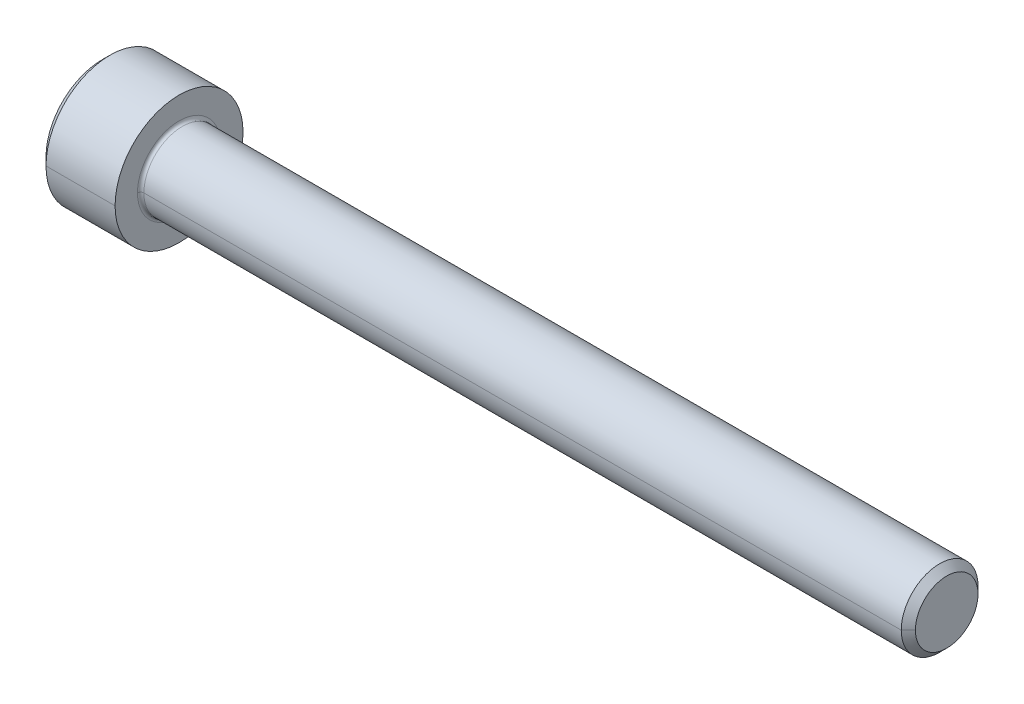
ISO-10303-21;
HEADER;
FILE_DESCRIPTION(('STEP AP214'),'2;1');
FILE_NAME('part.step','',(''),(''),'','','');
FILE_SCHEMA(('AUTOMOTIVE_DESIGN { 1 0 10303 214 1 1 1 1 }'));
ENDSEC;
DATA;
#1=APPLICATION_CONTEXT('core data for automotive mechanical design processes');
#2=APPLICATION_PROTOCOL_DEFINITION('international standard','automotive_design',2000,#1);
#3=PRODUCT_CONTEXT('',#1,'mechanical');
#4=PRODUCT('Part','Part','',(#3));
#5=PRODUCT_RELATED_PRODUCT_CATEGORY('part','',(#4));
#6=PRODUCT_DEFINITION_FORMATION('','',#4);
#7=PRODUCT_DEFINITION_CONTEXT('part definition',#1,'design');
#8=PRODUCT_DEFINITION('design','',#6,#7);
#9=PRODUCT_DEFINITION_SHAPE('','',#8);
#10=(LENGTH_UNIT() NAMED_UNIT(*) SI_UNIT(.MILLI.,.METRE.));
#11=(NAMED_UNIT(*) PLANE_ANGLE_UNIT() SI_UNIT($,.RADIAN.));
#12=(NAMED_UNIT(*) SI_UNIT($,.STERADIAN.) SOLID_ANGLE_UNIT());
#13=UNCERTAINTY_MEASURE_WITH_UNIT(LENGTH_MEASURE(1.E-05),#10,'distance_accuracy_value','');
#14=(GEOMETRIC_REPRESENTATION_CONTEXT(3) GLOBAL_UNCERTAINTY_ASSIGNED_CONTEXT((#13)) GLOBAL_UNIT_ASSIGNED_CONTEXT((#10,
#11,#12)) REPRESENTATION_CONTEXT('',''));
#15=CARTESIAN_POINT('',(0.,0.,0.));
#16=DIRECTION('',(0.,0.,1.));
#17=DIRECTION('',(1.,0.,0.));
#18=AXIS2_PLACEMENT_3D('',#15,#16,#17);
#19=CARTESIAN_POINT('',(3.,0.,0.));
#20=DIRECTION('',(-1.,0.,0.));
#21=DIRECTION('',(0.,0.,1.));
#22=AXIS2_PLACEMENT_3D('',#19,#20,#21);
#23=CONICAL_SURFACE('',#22,2.542,1.0471975511966);
#24=DIRECTION('',(-0.5,0.,-0.866025403784437));
#25=VECTOR('',#24,1.);
#26=CARTESIAN_POINT('',(3.,0.,-2.542));
#27=LINE('',#26,#25);
#28=CARTESIAN_POINT('',(4.46762438428004,0.,0.));
#29=VERTEX_POINT('',#28);
#30=CARTESIAN_POINT('',(3.,0.,-2.542));
#31=VERTEX_POINT('',#30);
#32=EDGE_CURVE('E348',#29,#31,#27,.T.);
#33=ORIENTED_EDGE('',*,*,#32,.F.);
#34=DIRECTION('',(-0.5,0.,0.866025403784437));
#35=VECTOR('',#34,1.);
#36=CARTESIAN_POINT('',(3.,0.,2.542));
#37=LINE('',#36,#35);
#38=CARTESIAN_POINT('',(3.,0.,2.542));
#39=VERTEX_POINT('',#38);
#40=EDGE_CURVE('E352',#29,#39,#37,.T.);
#41=ORIENTED_EDGE('',*,*,#40,.T.);
#42=CARTESIAN_POINT('',(3.,0.,0.));
#43=DIRECTION('',(-1.,0.,0.));
#44=DIRECTION('',(0.,0.,1.));
#45=AXIS2_PLACEMENT_3D('',#42,#43,#44);
#46=CIRCLE('',#45,2.542);
#47=CARTESIAN_POINT('',(3.,2.20143657642005,1.271));
#48=VERTEX_POINT('',#47);
#49=EDGE_CURVE('E174',#39,#48,#46,.T.);
#50=ORIENTED_EDGE('',*,*,#49,.T.);
#51=CARTESIAN_POINT('',(3.,0.,0.));
#52=DIRECTION('',(-1.,0.,0.));
#53=DIRECTION('',(0.,0.,1.));
#54=AXIS2_PLACEMENT_3D('',#51,#52,#53);
#55=CIRCLE('',#54,2.542);
#56=CARTESIAN_POINT('',(3.,2.20143657642004,-1.271));
#57=VERTEX_POINT('',#56);
#58=EDGE_CURVE('E24',#48,#57,#55,.T.);
#59=ORIENTED_EDGE('',*,*,#58,.T.);
#60=CARTESIAN_POINT('',(3.,0.,0.));
#61=DIRECTION('',(-1.,0.,0.));
#62=DIRECTION('',(0.,0.,1.));
#63=AXIS2_PLACEMENT_3D('',#60,#61,#62);
#64=CIRCLE('',#63,2.542);
#65=EDGE_CURVE('E11',#57,#31,#64,.T.);
#66=ORIENTED_EDGE('',*,*,#65,.T.);
#67=EDGE_LOOP('',(#33,#41,#50,#59,#66));
#68=FACE_BOUND('',#67,.T.);
#69=ADVANCED_FACE('F16',(#68),#23,.F.);
#70=CARTESIAN_POINT('',(3.,4.40287315284008,-2.542));
#71=DIRECTION('',(1.,0.,0.));
#72=DIRECTION('',(0.,1.,0.));
#73=AXIS2_PLACEMENT_3D('',#70,#71,#72);
#74=PLANE('',#73);
#75=DIRECTION('',(0.,-0.5,-0.866025403784438));
#76=VECTOR('',#75,1.);
#77=CARTESIAN_POINT('',(3.,2.93524876856006,0.));
#78=LINE('',#77,#76);
#79=CARTESIAN_POINT('',(3.,1.46762438428002,-2.542));
#80=VERTEX_POINT('',#79);
#81=EDGE_CURVE('E45',#57,#80,#78,.T.);
#82=ORIENTED_EDGE('',*,*,#81,.T.);
#83=DIRECTION('',(0.,-1.,0.));
#84=VECTOR('',#83,1.);
#85=CARTESIAN_POINT('',(3.,1.46762438428002,-2.542));
#86=LINE('',#85,#84);
#87=EDGE_CURVE('E162',#80,#31,#86,.T.);
#88=ORIENTED_EDGE('',*,*,#87,.T.);
#89=ORIENTED_EDGE('',*,*,#65,.F.);
#90=EDGE_LOOP('',(#82,#88,#89));
#91=FACE_BOUND('',#90,.T.);
#92=ADVANCED_FACE('F447',(#91),#74,.F.);
#93=CARTESIAN_POINT('',(3.,4.40287315284008,-2.542));
#94=DIRECTION('',(1.,0.,0.));
#95=DIRECTION('',(0.,1.,0.));
#96=AXIS2_PLACEMENT_3D('',#93,#94,#95);
#97=PLANE('',#96);
#98=DIRECTION('',(0.,-0.5,0.86602540378444));
#99=VECTOR('',#98,1.);
#100=CARTESIAN_POINT('',(3.,2.93524876856006,0.));
#101=LINE('',#100,#99);
#102=CARTESIAN_POINT('',(3.,2.93524876856006,0.));
#103=VERTEX_POINT('',#102);
#104=EDGE_CURVE('E190',#103,#48,#101,.T.);
#105=ORIENTED_EDGE('',*,*,#104,.F.);
#106=DIRECTION('',(0.,-0.5,-0.866025403784438));
#107=VECTOR('',#106,1.);
#108=CARTESIAN_POINT('',(3.,2.93524876856006,0.));
#109=LINE('',#108,#107);
#110=EDGE_CURVE('E170',#103,#57,#109,.T.);
#111=ORIENTED_EDGE('',*,*,#110,.T.);
#112=ORIENTED_EDGE('',*,*,#58,.F.);
#113=EDGE_LOOP('',(#105,#111,#112));
#114=FACE_BOUND('',#113,.T.);
#115=ADVANCED_FACE('F188',(#114),#97,.F.);
#116=CARTESIAN_POINT('',(3.,4.40287315284008,-2.542));
#117=DIRECTION('',(1.,0.,0.));
#118=DIRECTION('',(0.,1.,0.));
#119=AXIS2_PLACEMENT_3D('',#116,#117,#118);
#120=PLANE('',#119);
#121=DIRECTION('',(0.,1.,0.));
#122=VECTOR('',#121,1.);
#123=CARTESIAN_POINT('',(3.,-1.46762438428003,2.542));
#124=LINE('',#123,#122);
#125=CARTESIAN_POINT('',(3.,1.46762438428003,2.542));
#126=VERTEX_POINT('',#125);
#127=EDGE_CURVE('E215',#39,#126,#124,.T.);
#128=ORIENTED_EDGE('',*,*,#127,.T.);
#129=DIRECTION('',(0.,-0.5,0.86602540378444));
#130=VECTOR('',#129,1.);
#131=CARTESIAN_POINT('',(3.,2.93524876856006,0.));
#132=LINE('',#131,#130);
#133=EDGE_CURVE('E221',#48,#126,#132,.T.);
#134=ORIENTED_EDGE('',*,*,#133,.F.);
#135=ORIENTED_EDGE('',*,*,#49,.F.);
#136=EDGE_LOOP('',(#128,#134,#135));
#137=FACE_BOUND('',#136,.T.);
#138=ADVANCED_FACE('F456',(#137),#120,.F.);
#139=CARTESIAN_POINT('',(3.,4.40287315284008,-2.542));
#140=DIRECTION('',(1.,0.,0.));
#141=DIRECTION('',(0.,1.,0.));
#142=AXIS2_PLACEMENT_3D('',#139,#140,#141);
#143=PLANE('',#142);
#144=DIRECTION('',(0.,-0.5,-0.866025403784438));
#145=VECTOR('',#144,1.);
#146=CARTESIAN_POINT('',(3.,-1.46762438428003,2.542));
#147=LINE('',#146,#145);
#148=CARTESIAN_POINT('',(3.,-1.46762438428003,2.542));
#149=VERTEX_POINT('',#148);
#150=CARTESIAN_POINT('',(3.,-2.20143657642005,1.271));
#151=VERTEX_POINT('',#150);
#152=EDGE_CURVE('E144',#149,#151,#147,.T.);
#153=ORIENTED_EDGE('',*,*,#152,.F.);
#154=DIRECTION('',(0.,1.,0.));
#155=VECTOR('',#154,1.);
#156=CARTESIAN_POINT('',(3.,-1.46762438428003,2.542));
#157=LINE('',#156,#155);
#158=EDGE_CURVE('E211',#149,#39,#157,.T.);
#159=ORIENTED_EDGE('',*,*,#158,.T.);
#160=CARTESIAN_POINT('',(3.,0.,0.));
#161=DIRECTION('',(-1.,0.,0.));
#162=DIRECTION('',(0.,0.,1.));
#163=AXIS2_PLACEMENT_3D('',#160,#161,#162);
#164=CIRCLE('',#163,2.542);
#165=EDGE_CURVE('E336',#151,#39,#164,.T.);
#166=ORIENTED_EDGE('',*,*,#165,.F.);
#167=EDGE_LOOP('',(#153,#159,#166));
#168=FACE_BOUND('',#167,.T.);
#169=ADVANCED_FACE('F461',(#168),#143,.F.);
#170=CARTESIAN_POINT('',(3.,4.40287315284008,-2.542));
#171=DIRECTION('',(1.,0.,0.));
#172=DIRECTION('',(0.,1.,0.));
#173=AXIS2_PLACEMENT_3D('',#170,#171,#172);
#174=PLANE('',#173);
#175=DIRECTION('',(0.,0.5,-0.86602540378444));
#176=VECTOR('',#175,1.);
#177=CARTESIAN_POINT('',(3.,-2.93524876856006,0.));
#178=LINE('',#177,#176);
#179=CARTESIAN_POINT('',(3.,-2.93524876856006,0.));
#180=VERTEX_POINT('',#179);
#181=CARTESIAN_POINT('',(3.,-2.20143657642005,-1.271));
#182=VERTEX_POINT('',#181);
#183=EDGE_CURVE('E116',#180,#182,#178,.T.);
#184=ORIENTED_EDGE('',*,*,#183,.F.);
#185=DIRECTION('',(0.,-0.5,-0.866025403784438));
#186=VECTOR('',#185,1.);
#187=CARTESIAN_POINT('',(3.,-1.46762438428003,2.542));
#188=LINE('',#187,#186);
#189=EDGE_CURVE('E121',#151,#180,#188,.T.);
#190=ORIENTED_EDGE('',*,*,#189,.F.);
#191=CARTESIAN_POINT('',(3.,0.,0.));
#192=DIRECTION('',(-1.,0.,0.));
#193=DIRECTION('',(0.,0.,1.));
#194=AXIS2_PLACEMENT_3D('',#191,#192,#193);
#195=CIRCLE('',#194,2.542);
#196=EDGE_CURVE('E125',#182,#151,#195,.T.);
#197=ORIENTED_EDGE('',*,*,#196,.F.);
#198=EDGE_LOOP('',(#184,#190,#197));
#199=FACE_BOUND('',#198,.T.);
#200=ADVANCED_FACE('F118',(#199),#174,.F.);
#201=CARTESIAN_POINT('',(3.,4.40287315284008,-2.542));
#202=DIRECTION('',(1.,0.,0.));
#203=DIRECTION('',(0.,1.,0.));
#204=AXIS2_PLACEMENT_3D('',#201,#202,#203);
#205=PLANE('',#204);
#206=DIRECTION('',(0.,-1.,0.));
#207=VECTOR('',#206,1.);
#208=CARTESIAN_POINT('',(3.,1.46762438428002,-2.542));
#209=LINE('',#208,#207);
#210=CARTESIAN_POINT('',(3.,-1.46762438428004,-2.542));
#211=VERTEX_POINT('',#210);
#212=EDGE_CURVE('E165',#31,#211,#209,.T.);
#213=ORIENTED_EDGE('',*,*,#212,.T.);
#214=DIRECTION('',(0.,0.5,-0.86602540378444));
#215=VECTOR('',#214,1.);
#216=CARTESIAN_POINT('',(3.,-2.93524876856006,0.));
#217=LINE('',#216,#215);
#218=EDGE_CURVE('E130',#182,#211,#217,.T.);
#219=ORIENTED_EDGE('',*,*,#218,.F.);
#220=CARTESIAN_POINT('',(3.,0.,0.));
#221=DIRECTION('',(-1.,0.,0.));
#222=DIRECTION('',(0.,0.,1.));
#223=AXIS2_PLACEMENT_3D('',#220,#221,#222);
#224=CIRCLE('',#223,2.542);
#225=EDGE_CURVE('E345',#31,#182,#224,.T.);
#226=ORIENTED_EDGE('',*,*,#225,.F.);
#227=EDGE_LOOP('',(#213,#219,#226));
#228=FACE_BOUND('',#227,.T.);
#229=ADVANCED_FACE('F468',(#228),#205,.F.);
#230=CARTESIAN_POINT('',(3.,2.93524876856006,0.));
#231=DIRECTION('',(0.,0.866025403784438,-0.5));
#232=DIRECTION('',(-1.,0.,0.));
#233=AXIS2_PLACEMENT_3D('',#230,#231,#232);
#234=PLANE('',#233);
#235=DIRECTION('',(0.,-0.5,-0.866025403784438));
#236=VECTOR('',#235,1.);
#237=CARTESIAN_POINT('',(0.,2.93524876856006,0.));
#238=LINE('',#237,#236);
#239=CARTESIAN_POINT('',(0.,2.93524876856006,0.));
#240=VERTEX_POINT('',#239);
#241=CARTESIAN_POINT('',(0.,1.46762438428002,-2.542));
#242=VERTEX_POINT('',#241);
#243=EDGE_CURVE('E197',#240,#242,#238,.T.);
#244=ORIENTED_EDGE('',*,*,#243,.T.);
#245=DIRECTION('',(-1.,0.,0.));
#246=VECTOR('',#245,1.);
#247=CARTESIAN_POINT('',(3.,1.46762438428002,-2.542));
#248=LINE('',#247,#246);
#249=EDGE_CURVE('E159',#80,#242,#248,.T.);
#250=ORIENTED_EDGE('',*,*,#249,.F.);
#251=ORIENTED_EDGE('',*,*,#81,.F.);
#252=ORIENTED_EDGE('',*,*,#110,.F.);
#253=DIRECTION('',(-1.,0.,0.));
#254=VECTOR('',#253,1.);
#255=CARTESIAN_POINT('',(3.,2.93524876856006,0.));
#256=LINE('',#255,#254);
#257=EDGE_CURVE('E227',#103,#240,#256,.T.);
#258=ORIENTED_EDGE('',*,*,#257,.T.);
#259=EDGE_LOOP('',(#244,#250,#251,#252,#258));
#260=FACE_BOUND('',#259,.T.);
#261=ADVANCED_FACE('F194',(#260),#234,.F.);
#262=CARTESIAN_POINT('',(3.,1.46762438428002,-2.542));
#263=DIRECTION('',(0.,0.,-1.));
#264=DIRECTION('',(0.,-1.,0.));
#265=AXIS2_PLACEMENT_3D('',#262,#263,#264);
#266=PLANE('',#265);
#267=DIRECTION('',(0.,-1.,0.));
#268=VECTOR('',#267,1.);
#269=CARTESIAN_POINT('',(0.,1.46762438428002,-2.542));
#270=LINE('',#269,#268);
#271=CARTESIAN_POINT('',(0.,-1.46762438428004,-2.542));
#272=VERTEX_POINT('',#271);
#273=EDGE_CURVE('E245',#242,#272,#270,.T.);
#274=ORIENTED_EDGE('',*,*,#273,.T.);
#275=DIRECTION('',(-1.,0.,0.));
#276=VECTOR('',#275,1.);
#277=CARTESIAN_POINT('',(3.,-1.46762438428004,-2.542));
#278=LINE('',#277,#276);
#279=EDGE_CURVE('E158',#211,#272,#278,.T.);
#280=ORIENTED_EDGE('',*,*,#279,.F.);
#281=ORIENTED_EDGE('',*,*,#212,.F.);
#282=ORIENTED_EDGE('',*,*,#87,.F.);
#283=ORIENTED_EDGE('',*,*,#249,.T.);
#284=EDGE_LOOP('',(#274,#280,#281,#282,#283));
#285=FACE_BOUND('',#284,.T.);
#286=ADVANCED_FACE('F202',(#285),#266,.F.);
#287=CARTESIAN_POINT('',(3.,-2.93524876856006,0.));
#288=DIRECTION('',(0.,0.86602540378444,0.5));
#289=DIRECTION('',(1.,0.,0.));
#290=AXIS2_PLACEMENT_3D('',#287,#288,#289);
#291=PLANE('',#290);
#292=DIRECTION('',(0.,0.5,-0.86602540378444));
#293=VECTOR('',#292,1.);
#294=CARTESIAN_POINT('',(0.,-2.93524876856006,0.));
#295=LINE('',#294,#293);
#296=CARTESIAN_POINT('',(0.,-2.93524876856006,0.));
#297=VERTEX_POINT('',#296);
#298=EDGE_CURVE('E136',#297,#272,#295,.T.);
#299=ORIENTED_EDGE('',*,*,#298,.F.);
#300=DIRECTION('',(-1.,0.,0.));
#301=VECTOR('',#300,1.);
#302=CARTESIAN_POINT('',(3.,-2.93524876856006,0.));
#303=LINE('',#302,#301);
#304=EDGE_CURVE('E131',#180,#297,#303,.T.);
#305=ORIENTED_EDGE('',*,*,#304,.F.);
#306=ORIENTED_EDGE('',*,*,#183,.T.);
#307=ORIENTED_EDGE('',*,*,#218,.T.);
#308=ORIENTED_EDGE('',*,*,#279,.T.);
#309=EDGE_LOOP('',(#299,#305,#306,#307,#308));
#310=FACE_BOUND('',#309,.T.);
#311=ADVANCED_FACE('F134',(#310),#291,.T.);
#312=CARTESIAN_POINT('',(3.,-1.46762438428003,2.542));
#313=DIRECTION('',(0.,0.866025403784438,-0.5));
#314=DIRECTION('',(-1.,0.,0.));
#315=AXIS2_PLACEMENT_3D('',#312,#313,#314);
#316=PLANE('',#315);
#317=DIRECTION('',(0.,-0.5,-0.866025403784438));
#318=VECTOR('',#317,1.);
#319=CARTESIAN_POINT('',(0.,-1.46762438428003,2.542));
#320=LINE('',#319,#318);
#321=CARTESIAN_POINT('',(0.,-1.46762438428003,2.542));
#322=VERTEX_POINT('',#321);
#323=EDGE_CURVE('E250',#322,#297,#320,.T.);
#324=ORIENTED_EDGE('',*,*,#323,.F.);
#325=DIRECTION('',(-1.,0.,0.));
#326=VECTOR('',#325,1.);
#327=CARTESIAN_POINT('',(3.,-1.46762438428003,2.542));
#328=LINE('',#327,#326);
#329=EDGE_CURVE('E152',#149,#322,#328,.T.);
#330=ORIENTED_EDGE('',*,*,#329,.F.);
#331=ORIENTED_EDGE('',*,*,#152,.T.);
#332=ORIENTED_EDGE('',*,*,#189,.T.);
#333=ORIENTED_EDGE('',*,*,#304,.T.);
#334=EDGE_LOOP('',(#324,#330,#331,#332,#333));
#335=FACE_BOUND('',#334,.T.);
#336=ADVANCED_FACE('F142',(#335),#316,.T.);
#337=CARTESIAN_POINT('',(3.,-1.46762438428003,2.542));
#338=DIRECTION('',(0.,0.,1.));
#339=DIRECTION('',(0.,-1.,0.));
#340=AXIS2_PLACEMENT_3D('',#337,#338,#339);
#341=PLANE('',#340);
#342=DIRECTION('',(0.,1.,0.));
#343=VECTOR('',#342,1.);
#344=CARTESIAN_POINT('',(0.,-1.46762438428003,2.542));
#345=LINE('',#344,#343);
#346=CARTESIAN_POINT('',(0.,1.46762438428003,2.542));
#347=VERTEX_POINT('',#346);
#348=EDGE_CURVE('E251',#322,#347,#345,.T.);
#349=ORIENTED_EDGE('',*,*,#348,.T.);
#350=DIRECTION('',(-1.,0.,0.));
#351=VECTOR('',#350,1.);
#352=CARTESIAN_POINT('',(3.,1.46762438428003,2.542));
#353=LINE('',#352,#351);
#354=EDGE_CURVE('E218',#126,#347,#353,.T.);
#355=ORIENTED_EDGE('',*,*,#354,.F.);
#356=ORIENTED_EDGE('',*,*,#127,.F.);
#357=ORIENTED_EDGE('',*,*,#158,.F.);
#358=ORIENTED_EDGE('',*,*,#329,.T.);
#359=EDGE_LOOP('',(#349,#355,#356,#357,#358));
#360=FACE_BOUND('',#359,.T.);
#361=ADVANCED_FACE('F480',(#360),#341,.F.);
#362=CARTESIAN_POINT('',(3.,2.93524876856006,0.));
#363=DIRECTION('',(0.,-0.86602540378444,-0.5));
#364=DIRECTION('',(0.,0.5,-0.86602540378444));
#365=AXIS2_PLACEMENT_3D('',#362,#363,#364);
#366=PLANE('',#365);
#367=DIRECTION('',(0.,-0.5,0.86602540378444));
#368=VECTOR('',#367,1.);
#369=CARTESIAN_POINT('',(0.,2.93524876856006,0.));
#370=LINE('',#369,#368);
#371=EDGE_CURVE('E255',#240,#347,#370,.T.);
#372=ORIENTED_EDGE('',*,*,#371,.F.);
#373=ORIENTED_EDGE('',*,*,#257,.F.);
#374=ORIENTED_EDGE('',*,*,#104,.T.);
#375=ORIENTED_EDGE('',*,*,#133,.T.);
#376=ORIENTED_EDGE('',*,*,#354,.T.);
#377=EDGE_LOOP('',(#372,#373,#374,#375,#376));
#378=FACE_BOUND('',#377,.T.);
#379=ADVANCED_FACE('F484',(#378),#366,.T.);
#380=CARTESIAN_POINT('',(6.25,0.,0.));
#381=DIRECTION('',(1.,0.,0.));
#382=DIRECTION('',(0.,0.,-1.));
#383=AXIS2_PLACEMENT_3D('',#380,#381,#382);
#384=TOROIDAL_SURFACE('',#383,3.24999999999995,0.25);
#385=CARTESIAN_POINT('',(6.25,0.,3.24999999999995));
#386=DIRECTION('',(0.,1.,0.));
#387=DIRECTION('',(0.,0.,1.));
#388=AXIS2_PLACEMENT_3D('',#385,#386,#387);
#389=CIRCLE('',#388,0.25);
#390=CARTESIAN_POINT('',(6.25,0.,2.99999999999996));
#391=VERTEX_POINT('',#390);
#392=CARTESIAN_POINT('',(6.,0.,3.24999999999995));
#393=VERTEX_POINT('',#392);
#394=EDGE_CURVE('E325',#391,#393,#389,.T.);
#395=ORIENTED_EDGE('',*,*,#394,.F.);
#396=CARTESIAN_POINT('',(6.25,0.,0.));
#397=DIRECTION('',(1.,0.,0.));
#398=DIRECTION('',(0.,0.,-1.));
#399=AXIS2_PLACEMENT_3D('',#396,#397,#398);
#400=CIRCLE('',#399,2.99999999999996);
#401=CARTESIAN_POINT('',(6.25,0.,-2.99999999999996));
#402=VERTEX_POINT('',#401);
#403=EDGE_CURVE('E273',#402,#391,#400,.T.);
#404=ORIENTED_EDGE('',*,*,#403,.F.);
#405=CARTESIAN_POINT('',(6.25,0.,-3.24999999999995));
#406=DIRECTION('',(0.,-1.,0.));
#407=DIRECTION('',(0.,0.,-1.));
#408=AXIS2_PLACEMENT_3D('',#405,#406,#407);
#409=CIRCLE('',#408,0.25);
#410=CARTESIAN_POINT('',(6.,0.,-3.24999999999995));
#411=VERTEX_POINT('',#410);
#412=EDGE_CURVE('E312',#402,#411,#409,.T.);
#413=ORIENTED_EDGE('',*,*,#412,.T.);
#414=CARTESIAN_POINT('',(6.,0.,0.));
#415=DIRECTION('',(-1.,0.,0.));
#416=DIRECTION('',(0.,0.,-1.));
#417=AXIS2_PLACEMENT_3D('',#414,#415,#416);
#418=CIRCLE('',#417,3.24999999999995);
#419=EDGE_CURVE('E232',#393,#411,#418,.T.);
#420=ORIENTED_EDGE('',*,*,#419,.F.);
#421=EDGE_LOOP('',(#395,#404,#413,#420));
#422=FACE_BOUND('',#421,.T.);
#423=ADVANCED_FACE('F481',(#422),#384,.F.);
#424=CARTESIAN_POINT('',(0.,0.,0.));
#425=DIRECTION('',(1.,0.,0.));
#426=DIRECTION('',(0.,0.,-1.));
#427=AXIS2_PLACEMENT_3D('',#424,#425,#426);
#428=CONICAL_SURFACE('',#427,4.4,0.785398163397442);
#429=DIRECTION('',(0.707106781186552,0.,0.707106781186544));
#430=VECTOR('',#429,1.);
#431=CARTESIAN_POINT('',(0.,0.,4.4));
#432=LINE('',#431,#430);
#433=CARTESIAN_POINT('',(0.,0.,4.4));
#434=VERTEX_POINT('',#433);
#435=CARTESIAN_POINT('',(0.6,0.,5.));
#436=VERTEX_POINT('',#435);
#437=EDGE_CURVE('E297',#434,#436,#432,.T.);
#438=ORIENTED_EDGE('',*,*,#437,.F.);
#439=CARTESIAN_POINT('',(0.,0.,0.));
#440=DIRECTION('',(-1.,0.,0.));
#441=DIRECTION('',(0.,0.,1.));
#442=AXIS2_PLACEMENT_3D('',#439,#440,#441);
#443=CIRCLE('',#442,4.4);
#444=CARTESIAN_POINT('',(0.,0.,-4.4));
#445=VERTEX_POINT('',#444);
#446=EDGE_CURVE('E259',#445,#434,#443,.T.);
#447=ORIENTED_EDGE('',*,*,#446,.F.);
#448=DIRECTION('',(0.707106781186552,0.,-0.707106781186544));
#449=VECTOR('',#448,1.);
#450=CARTESIAN_POINT('',(0.,0.,-4.4));
#451=LINE('',#450,#449);
#452=CARTESIAN_POINT('',(0.6,0.,-5.));
#453=VERTEX_POINT('',#452);
#454=EDGE_CURVE('E289',#445,#453,#451,.T.);
#455=ORIENTED_EDGE('',*,*,#454,.T.);
#456=CARTESIAN_POINT('',(0.6,0.,0.));
#457=DIRECTION('',(-1.,0.,0.));
#458=DIRECTION('',(0.,0.,1.));
#459=AXIS2_PLACEMENT_3D('',#456,#457,#458);
#460=CIRCLE('',#459,5.);
#461=EDGE_CURVE('E228',#453,#436,#460,.T.);
#462=ORIENTED_EDGE('',*,*,#461,.T.);
#463=EDGE_LOOP('',(#438,#447,#455,#462));
#464=FACE_BOUND('',#463,.T.);
#465=ADVANCED_FACE('F412',(#464),#428,.T.);
#466=CARTESIAN_POINT('',(-31.75,0.,0.));
#467=DIRECTION('',(-1.,0.,0.));
#468=DIRECTION('',(0.,0.,1.));
#469=AXIS2_PLACEMENT_3D('',#466,#467,#468);
#470=CYLINDRICAL_SURFACE('',#469,5.);
#471=DIRECTION('',(-1.,0.,0.));
#472=VECTOR('',#471,1.);
#473=CARTESIAN_POINT('',(-31.75,0.,-5.));
#474=LINE('',#473,#472);
#475=CARTESIAN_POINT('',(6.,0.,-5.));
#476=VERTEX_POINT('',#475);
#477=EDGE_CURVE('E305',#476,#453,#474,.T.);
#478=ORIENTED_EDGE('',*,*,#477,.F.);
#479=CARTESIAN_POINT('',(6.,0.,0.));
#480=DIRECTION('',(-1.,0.,0.));
#481=DIRECTION('',(0.,0.,1.));
#482=AXIS2_PLACEMENT_3D('',#479,#480,#481);
#483=CIRCLE('',#482,5.);
#484=CARTESIAN_POINT('',(6.,0.,5.));
#485=VERTEX_POINT('',#484);
#486=EDGE_CURVE('E233',#476,#485,#483,.T.);
#487=ORIENTED_EDGE('',*,*,#486,.T.);
#488=DIRECTION('',(-1.,0.,0.));
#489=VECTOR('',#488,1.);
#490=CARTESIAN_POINT('',(-31.75,0.,5.));
#491=LINE('',#490,#489);
#492=EDGE_CURVE('E288',#485,#436,#491,.T.);
#493=ORIENTED_EDGE('',*,*,#492,.T.);
#494=ORIENTED_EDGE('',*,*,#461,.F.);
#495=EDGE_LOOP('',(#478,#487,#493,#494));
#496=FACE_BOUND('',#495,.T.);
#497=ADVANCED_FACE('F419',(#496),#470,.T.);
#498=CARTESIAN_POINT('',(6.,5.,0.));
#499=DIRECTION('',(1.,0.,0.));
#500=DIRECTION('',(0.,1.,0.));
#501=AXIS2_PLACEMENT_3D('',#498,#499,#500);
#502=PLANE('',#501);
#503=CARTESIAN_POINT('',(6.,0.,0.));
#504=DIRECTION('',(-1.,0.,0.));
#505=DIRECTION('',(0.,0.,-1.));
#506=AXIS2_PLACEMENT_3D('',#503,#504,#505);
#507=CIRCLE('',#506,3.24999999999995);
#508=EDGE_CURVE('E316',#411,#393,#507,.T.);
#509=ORIENTED_EDGE('',*,*,#508,.T.);
#510=ORIENTED_EDGE('',*,*,#419,.T.);
#511=EDGE_LOOP('',(#509,#510));
#512=FACE_BOUND('',#511,.T.);
#513=CARTESIAN_POINT('',(6.,0.,0.));
#514=DIRECTION('',(-1.,0.,0.));
#515=DIRECTION('',(0.,0.,1.));
#516=AXIS2_PLACEMENT_3D('',#513,#514,#515);
#517=CIRCLE('',#516,5.);
#518=EDGE_CURVE('E293',#485,#476,#517,.T.);
#519=ORIENTED_EDGE('',*,*,#518,.F.);
#520=ORIENTED_EDGE('',*,*,#486,.F.);
#521=EDGE_LOOP('',(#519,#520));
#522=FACE_BOUND('',#521,.T.);
#523=ADVANCED_FACE('F488',(#512,#522),#502,.T.);
#524=CARTESIAN_POINT('',(-31.75,0.,0.));
#525=DIRECTION('',(-1.,0.,0.));
#526=DIRECTION('',(0.,0.,1.));
#527=AXIS2_PLACEMENT_3D('',#524,#525,#526);
#528=CYLINDRICAL_SURFACE('',#527,2.99999999999996);
#529=DIRECTION('',(-1.,0.,0.));
#530=VECTOR('',#529,1.);
#531=CARTESIAN_POINT('',(-31.75,0.,-2.99999999999996));
#532=LINE('',#531,#530);
#533=CARTESIAN_POINT('',(65.4455,0.,-2.9999999999999));
#534=VERTEX_POINT('',#533);
#535=EDGE_CURVE('E277',#534,#402,#532,.T.);
#536=ORIENTED_EDGE('',*,*,#535,.F.);
#537=CARTESIAN_POINT('',(65.4455,0.,0.));
#538=DIRECTION('',(-1.,0.,0.));
#539=DIRECTION('',(0.,0.,1.));
#540=AXIS2_PLACEMENT_3D('',#537,#538,#539);
#541=CIRCLE('',#540,2.9999999999999);
#542=CARTESIAN_POINT('',(65.4455,0.,2.9999999999999));
#543=VERTEX_POINT('',#542);
#544=EDGE_CURVE('E237',#534,#543,#541,.T.);
#545=ORIENTED_EDGE('',*,*,#544,.T.);
#546=DIRECTION('',(-1.,0.,0.));
#547=VECTOR('',#546,1.);
#548=CARTESIAN_POINT('',(-31.75,0.,2.99999999999996));
#549=LINE('',#548,#547);
#550=EDGE_CURVE('E269',#543,#391,#549,.T.);
#551=ORIENTED_EDGE('',*,*,#550,.T.);
#552=CARTESIAN_POINT('',(6.25,0.,0.));
#553=DIRECTION('',(1.,0.,0.));
#554=DIRECTION('',(0.,0.,-1.));
#555=AXIS2_PLACEMENT_3D('',#552,#553,#554);
#556=CIRCLE('',#555,2.99999999999996);
#557=EDGE_CURVE('E329',#391,#402,#556,.T.);
#558=ORIENTED_EDGE('',*,*,#557,.T.);
#559=EDGE_LOOP('',(#536,#545,#551,#558));
#560=FACE_BOUND('',#559,.T.);
#561=ADVANCED_FACE('F489',(#560),#528,.T.);
#562=CARTESIAN_POINT('',(66.,0.,0.));
#563=DIRECTION('',(-1.,0.,0.));
#564=DIRECTION('',(0.,0.,1.));
#565=AXIS2_PLACEMENT_3D('',#562,#563,#564);
#566=CONICAL_SURFACE('',#565,2.4455,0.785398163397286);
#567=DIRECTION('',(-0.707106781186662,0.,-0.707106781186433));
#568=VECTOR('',#567,1.);
#569=CARTESIAN_POINT('',(66.,0.,-2.4455));
#570=LINE('',#569,#568);
#571=CARTESIAN_POINT('',(66.,0.,-2.4455));
#572=VERTEX_POINT('',#571);
#573=EDGE_CURVE('E264',#572,#534,#570,.T.);
#574=ORIENTED_EDGE('',*,*,#573,.F.);
#575=CARTESIAN_POINT('',(66.,0.,0.));
#576=DIRECTION('',(-1.,0.,0.));
#577=DIRECTION('',(0.,0.,1.));
#578=AXIS2_PLACEMENT_3D('',#575,#576,#577);
#579=CIRCLE('',#578,2.4455);
#580=CARTESIAN_POINT('',(66.,0.,2.4455));
#581=VERTEX_POINT('',#580);
#582=EDGE_CURVE('E240',#572,#581,#579,.T.);
#583=ORIENTED_EDGE('',*,*,#582,.T.);
#584=DIRECTION('',(-0.707106781186662,0.,0.707106781186433));
#585=VECTOR('',#584,1.);
#586=CARTESIAN_POINT('',(66.,0.,2.4455));
#587=LINE('',#586,#585);
#588=EDGE_CURVE('E263',#581,#543,#587,.T.);
#589=ORIENTED_EDGE('',*,*,#588,.T.);
#590=ORIENTED_EDGE('',*,*,#544,.F.);
#591=EDGE_LOOP('',(#574,#583,#589,#590));
#592=FACE_BOUND('',#591,.T.);
#593=ADVANCED_FACE('F442',(#592),#566,.T.);
#594=CARTESIAN_POINT('',(66.,2.4455,0.));
#595=DIRECTION('',(1.,0.,0.));
#596=DIRECTION('',(0.,1.,0.));
#597=AXIS2_PLACEMENT_3D('',#594,#595,#596);
#598=PLANE('',#597);
#599=CARTESIAN_POINT('',(66.,0.,0.));
#600=DIRECTION('',(-1.,0.,0.));
#601=DIRECTION('',(0.,0.,1.));
#602=AXIS2_PLACEMENT_3D('',#599,#600,#601);
#603=CIRCLE('',#602,2.4455);
#604=EDGE_CURVE('E268',#581,#572,#603,.T.);
#605=ORIENTED_EDGE('',*,*,#604,.F.);
#606=ORIENTED_EDGE('',*,*,#582,.F.);
#607=EDGE_LOOP('',(#605,#606));
#608=FACE_BOUND('',#607,.T.);
#609=ADVANCED_FACE('F430',(#608),#598,.T.);
#610=CARTESIAN_POINT('',(0.,0.,0.));
#611=DIRECTION('',(-1.,0.,0.));
#612=DIRECTION('',(0.,0.,1.));
#613=AXIS2_PLACEMENT_3D('',#610,#611,#612);
#614=PLANE('',#613);
#615=ORIENTED_EDGE('',*,*,#371,.T.);
#616=ORIENTED_EDGE('',*,*,#348,.F.);
#617=ORIENTED_EDGE('',*,*,#323,.T.);
#618=ORIENTED_EDGE('',*,*,#298,.T.);
#619=ORIENTED_EDGE('',*,*,#273,.F.);
#620=ORIENTED_EDGE('',*,*,#243,.F.);
#621=EDGE_LOOP('',(#615,#616,#617,#618,#619,#620));
#622=FACE_BOUND('',#621,.T.);
#623=ORIENTED_EDGE('',*,*,#446,.T.);
#624=CARTESIAN_POINT('',(0.,0.,0.));
#625=DIRECTION('',(-1.,0.,0.));
#626=DIRECTION('',(0.,0.,1.));
#627=AXIS2_PLACEMENT_3D('',#624,#625,#626);
#628=CIRCLE('',#627,4.4);
#629=EDGE_CURVE('E301',#434,#445,#628,.T.);
#630=ORIENTED_EDGE('',*,*,#629,.T.);
#631=EDGE_LOOP('',(#623,#630));
#632=FACE_BOUND('',#631,.T.);
#633=ADVANCED_FACE('F427',(#622,#632),#614,.T.);
#634=CARTESIAN_POINT('',(66.,0.,0.));
#635=DIRECTION('',(-1.,0.,0.));
#636=DIRECTION('',(0.,0.,1.));
#637=AXIS2_PLACEMENT_3D('',#634,#635,#636);
#638=CONICAL_SURFACE('',#637,2.4455,0.785398163397286);
#639=ORIENTED_EDGE('',*,*,#604,.T.);
#640=ORIENTED_EDGE('',*,*,#573,.T.);
#641=CARTESIAN_POINT('',(65.4455,0.,0.));
#642=DIRECTION('',(-1.,0.,0.));
#643=DIRECTION('',(0.,0.,1.));
#644=AXIS2_PLACEMENT_3D('',#641,#642,#643);
#645=CIRCLE('',#644,2.9999999999999);
#646=EDGE_CURVE('E281',#543,#534,#645,.T.);
#647=ORIENTED_EDGE('',*,*,#646,.F.);
#648=ORIENTED_EDGE('',*,*,#588,.F.);
#649=EDGE_LOOP('',(#639,#640,#647,#648));
#650=FACE_BOUND('',#649,.T.);
#651=ADVANCED_FACE('F429',(#650),#638,.T.);
#652=CARTESIAN_POINT('',(-31.75,0.,0.));
#653=DIRECTION('',(-1.,0.,0.));
#654=DIRECTION('',(0.,0.,1.));
#655=AXIS2_PLACEMENT_3D('',#652,#653,#654);
#656=CYLINDRICAL_SURFACE('',#655,2.99999999999996);
#657=ORIENTED_EDGE('',*,*,#646,.T.);
#658=ORIENTED_EDGE('',*,*,#535,.T.);
#659=ORIENTED_EDGE('',*,*,#403,.T.);
#660=ORIENTED_EDGE('',*,*,#550,.F.);
#661=EDGE_LOOP('',(#657,#658,#659,#660));
#662=FACE_BOUND('',#661,.T.);
#663=ADVANCED_FACE('F439',(#662),#656,.T.);
#664=CARTESIAN_POINT('',(-31.75,0.,0.));
#665=DIRECTION('',(-1.,0.,0.));
#666=DIRECTION('',(0.,0.,1.));
#667=AXIS2_PLACEMENT_3D('',#664,#665,#666);
#668=CYLINDRICAL_SURFACE('',#667,5.);
#669=ORIENTED_EDGE('',*,*,#518,.T.);
#670=ORIENTED_EDGE('',*,*,#477,.T.);
#671=CARTESIAN_POINT('',(0.6,0.,0.));
#672=DIRECTION('',(-1.,0.,0.));
#673=DIRECTION('',(0.,0.,1.));
#674=AXIS2_PLACEMENT_3D('',#671,#672,#673);
#675=CIRCLE('',#674,5.);
#676=EDGE_CURVE('E294',#436,#453,#675,.T.);
#677=ORIENTED_EDGE('',*,*,#676,.F.);
#678=ORIENTED_EDGE('',*,*,#492,.F.);
#679=EDGE_LOOP('',(#669,#670,#677,#678));
#680=FACE_BOUND('',#679,.T.);
#681=ADVANCED_FACE('F423',(#680),#668,.T.);
#682=CARTESIAN_POINT('',(0.,0.,0.));
#683=DIRECTION('',(1.,0.,0.));
#684=DIRECTION('',(0.,0.,-1.));
#685=AXIS2_PLACEMENT_3D('',#682,#683,#684);
#686=CONICAL_SURFACE('',#685,4.4,0.785398163397442);
#687=ORIENTED_EDGE('',*,*,#629,.F.);
#688=ORIENTED_EDGE('',*,*,#437,.T.);
#689=ORIENTED_EDGE('',*,*,#676,.T.);
#690=ORIENTED_EDGE('',*,*,#454,.F.);
#691=EDGE_LOOP('',(#687,#688,#689,#690));
#692=FACE_BOUND('',#691,.T.);
#693=ADVANCED_FACE('F425',(#692),#686,.T.);
#694=CARTESIAN_POINT('',(6.25,0.,0.));
#695=DIRECTION('',(1.,0.,0.));
#696=DIRECTION('',(0.,0.,-1.));
#697=AXIS2_PLACEMENT_3D('',#694,#695,#696);
#698=TOROIDAL_SURFACE('',#697,3.24999999999995,0.25);
#699=ORIENTED_EDGE('',*,*,#557,.F.);
#700=ORIENTED_EDGE('',*,*,#394,.T.);
#701=ORIENTED_EDGE('',*,*,#508,.F.);
#702=ORIENTED_EDGE('',*,*,#412,.F.);
#703=EDGE_LOOP('',(#699,#700,#701,#702));
#704=FACE_BOUND('',#703,.T.);
#705=ADVANCED_FACE('F514',(#704),#698,.F.);
#706=CARTESIAN_POINT('',(3.,0.,0.));
#707=DIRECTION('',(-1.,0.,0.));
#708=DIRECTION('',(0.,0.,1.));
#709=AXIS2_PLACEMENT_3D('',#706,#707,#708);
#710=CONICAL_SURFACE('',#709,2.542,1.0471975511966);
#711=ORIENTED_EDGE('',*,*,#40,.F.);
#712=ORIENTED_EDGE('',*,*,#32,.T.);
#713=ORIENTED_EDGE('',*,*,#225,.T.);
#714=ORIENTED_EDGE('',*,*,#196,.T.);
#715=ORIENTED_EDGE('',*,*,#165,.T.);
#716=EDGE_LOOP('',(#711,#712,#713,#714,#715));
#717=FACE_BOUND('',#716,.T.);
#718=ADVANCED_FACE('F365',(#717),#710,.F.);
#719=CLOSED_SHELL('',(#69,#92,#115,#138,#169,#200,#229,#261,#286,#311,#336,#361,#379,#423,#465,
#497,#523,#561,#593,#609,#633,#651,#663,#681,#693,#705,#718));
#720=MANIFOLD_SOLID_BREP('B1',#719);
#721=ADVANCED_BREP_SHAPE_REPRESENTATION('',(#18,#720),#14);
#722=SHAPE_DEFINITION_REPRESENTATION(#9,#721);
ENDSEC;
END-ISO-10303-21;
